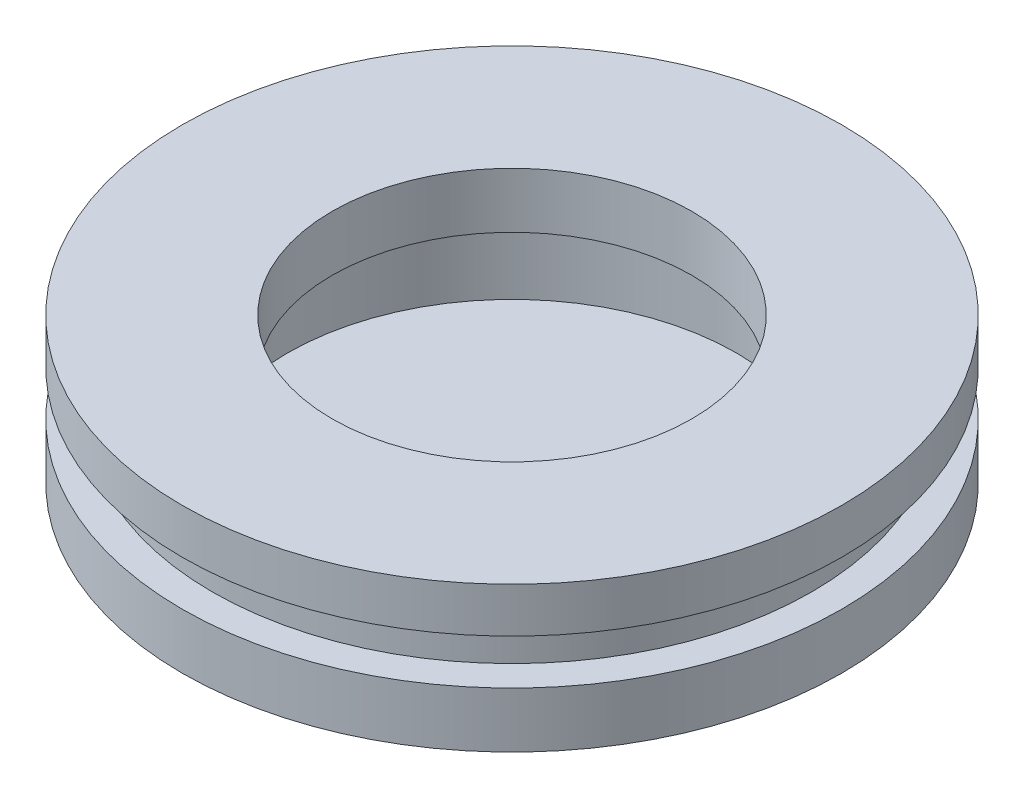
ISO-10303-21;
HEADER;
FILE_DESCRIPTION(('STEP AP214'),'2;1');
FILE_NAME('part.step','',(''),(''),'','','');
FILE_SCHEMA(('AUTOMOTIVE_DESIGN { 1 0 10303 214 1 1 1 1 }'));
ENDSEC;
DATA;
#1=APPLICATION_CONTEXT('core data for automotive mechanical design processes');
#2=APPLICATION_PROTOCOL_DEFINITION('international standard','automotive_design',2000,#1);
#3=PRODUCT_CONTEXT('',#1,'mechanical');
#4=PRODUCT('Part','Part','',(#3));
#5=PRODUCT_RELATED_PRODUCT_CATEGORY('part','',(#4));
#6=PRODUCT_DEFINITION_FORMATION('','',#4);
#7=PRODUCT_DEFINITION_CONTEXT('part definition',#1,'design');
#8=PRODUCT_DEFINITION('design','',#6,#7);
#9=PRODUCT_DEFINITION_SHAPE('','',#8);
#10=(LENGTH_UNIT() NAMED_UNIT(*) SI_UNIT(.MILLI.,.METRE.));
#11=(NAMED_UNIT(*) PLANE_ANGLE_UNIT() SI_UNIT($,.RADIAN.));
#12=(NAMED_UNIT(*) SI_UNIT($,.STERADIAN.) SOLID_ANGLE_UNIT());
#13=UNCERTAINTY_MEASURE_WITH_UNIT(LENGTH_MEASURE(1.E-05),#10,'distance_accuracy_value','');
#14=(GEOMETRIC_REPRESENTATION_CONTEXT(3) GLOBAL_UNCERTAINTY_ASSIGNED_CONTEXT((#13)) GLOBAL_UNIT_ASSIGNED_CONTEXT((#10,
#11,#12)) REPRESENTATION_CONTEXT('',''));
#15=CARTESIAN_POINT('',(0.,0.,0.));
#16=DIRECTION('',(0.,0.,1.));
#17=DIRECTION('',(1.,0.,0.));
#18=AXIS2_PLACEMENT_3D('',#15,#16,#17);
#19=CARTESIAN_POINT('',(0.,4.00367257692815,0.));
#20=DIRECTION('',(0.,1.,0.));
#21=DIRECTION('',(0.,0.,1.));
#22=AXIS2_PLACEMENT_3D('',#19,#20,#21);
#23=CONICAL_SURFACE('',#22,11.,1.22173047639604);
#24=CARTESIAN_POINT('',(0.,0.,0.));
#25=VERTEX_POINT('',#24);
#26=VERTEX_LOOP('',#25);
#27=FACE_BOUND('',#26,.T.);
#28=CARTESIAN_POINT('',(0.,4.00367257692815,0.));
#29=DIRECTION('',(0.,-1.,0.));
#30=DIRECTION('',(0.,0.,-1.));
#31=AXIS2_PLACEMENT_3D('',#28,#29,#30);
#32=CIRCLE('',#31,11.);
#33=CARTESIAN_POINT('',(0.,4.00367257692815,-11.));
#34=VERTEX_POINT('',#33);
#35=EDGE_CURVE('E49',#34,#34,#32,.T.);
#36=ORIENTED_EDGE('',*,*,#35,.T.);
#37=EDGE_LOOP('',(#36));
#38=FACE_BOUND('',#37,.T.);
#39=ADVANCED_FACE('F34',(#27,#38),#23,.T.);
#40=CARTESIAN_POINT('',(0.,8.85367257692815,0.));
#41=DIRECTION('',(0.,-1.,0.));
#42=DIRECTION('',(0.,0.,-1.));
#43=AXIS2_PLACEMENT_3D('',#40,#41,#42);
#44=PLANE('',#43);
#45=CARTESIAN_POINT('',(0.,8.85367257692815,0.));
#46=DIRECTION('',(0.,-1.,0.));
#47=DIRECTION('',(0.,0.,-1.));
#48=AXIS2_PLACEMENT_3D('',#45,#46,#47);
#49=CIRCLE('',#48,6.);
#50=CARTESIAN_POINT('',(0.,8.85367257692815,-6.));
#51=VERTEX_POINT('',#50);
#52=EDGE_CURVE('E37',#51,#51,#49,.F.);
#53=ORIENTED_EDGE('',*,*,#52,.F.);
#54=EDGE_LOOP('',(#53));
#55=FACE_BOUND('',#54,.T.);
#56=CARTESIAN_POINT('',(0.,8.85367257692815,0.));
#57=DIRECTION('',(0.,-1.,0.));
#58=DIRECTION('',(0.,0.,-1.));
#59=AXIS2_PLACEMENT_3D('',#56,#57,#58);
#60=CIRCLE('',#59,11.);
#61=CARTESIAN_POINT('',(0.,8.85367257692815,-11.));
#62=VERTEX_POINT('',#61);
#63=EDGE_CURVE('E11',#62,#62,#60,.T.);
#64=ORIENTED_EDGE('',*,*,#63,.F.);
#65=EDGE_LOOP('',(#64));
#66=FACE_BOUND('',#65,.T.);
#67=ADVANCED_FACE('F46',(#55,#66),#44,.F.);
#68=CARTESIAN_POINT('',(0.,0.,0.));
#69=DIRECTION('',(0.,-1.,0.));
#70=DIRECTION('',(0.,0.,-1.));
#71=AXIS2_PLACEMENT_3D('',#68,#69,#70);
#72=CYLINDRICAL_SURFACE('',#71,11.);
#73=CARTESIAN_POINT('',(0.,7.35367257692815,0.));
#74=DIRECTION('',(0.,-1.,0.));
#75=DIRECTION('',(0.,0.,-1.));
#76=AXIS2_PLACEMENT_3D('',#73,#74,#75);
#77=CIRCLE('',#76,11.);
#78=CARTESIAN_POINT('',(0.,7.35367257692815,-11.));
#79=VERTEX_POINT('',#78);
#80=EDGE_CURVE('E41',#79,#79,#77,.T.);
#81=ORIENTED_EDGE('',*,*,#80,.F.);
#82=EDGE_LOOP('',(#81));
#83=FACE_BOUND('',#82,.T.);
#84=ORIENTED_EDGE('',*,*,#63,.T.);
#85=EDGE_LOOP('',(#84));
#86=FACE_BOUND('',#85,.T.);
#87=ADVANCED_FACE('F71',(#83,#86),#72,.T.);
#88=CARTESIAN_POINT('',(-11.,7.35367257692815,0.));
#89=DIRECTION('',(0.,1.,0.));
#90=DIRECTION('',(0.,0.,1.));
#91=AXIS2_PLACEMENT_3D('',#88,#89,#90);
#92=PLANE('',#91);
#93=CARTESIAN_POINT('',(0.,7.35367257692815,0.));
#94=DIRECTION('',(0.,-1.,0.));
#95=DIRECTION('',(0.,0.,-1.));
#96=AXIS2_PLACEMENT_3D('',#93,#94,#95);
#97=CIRCLE('',#96,10.);
#98=CARTESIAN_POINT('',(0.,7.35367257692815,-10.));
#99=VERTEX_POINT('',#98);
#100=EDGE_CURVE('E63',#99,#99,#97,.T.);
#101=ORIENTED_EDGE('',*,*,#100,.F.);
#102=EDGE_LOOP('',(#101));
#103=FACE_BOUND('',#102,.T.);
#104=ORIENTED_EDGE('',*,*,#80,.T.);
#105=EDGE_LOOP('',(#104));
#106=FACE_BOUND('',#105,.T.);
#107=ADVANCED_FACE('F69',(#103,#106),#92,.F.);
#108=CARTESIAN_POINT('',(0.,0.,0.));
#109=DIRECTION('',(0.,-1.,0.));
#110=DIRECTION('',(0.,0.,-1.));
#111=AXIS2_PLACEMENT_3D('',#108,#109,#110);
#112=CYLINDRICAL_SURFACE('',#111,10.);
#113=CARTESIAN_POINT('',(0.,5.85367257692815,0.));
#114=DIRECTION('',(0.,-1.,0.));
#115=DIRECTION('',(0.,0.,-1.));
#116=AXIS2_PLACEMENT_3D('',#113,#114,#115);
#117=CIRCLE('',#116,10.);
#118=CARTESIAN_POINT('',(0.,5.85367257692815,-10.));
#119=VERTEX_POINT('',#118);
#120=EDGE_CURVE('E54',#119,#119,#117,.T.);
#121=ORIENTED_EDGE('',*,*,#120,.F.);
#122=EDGE_LOOP('',(#121));
#123=FACE_BOUND('',#122,.T.);
#124=ORIENTED_EDGE('',*,*,#100,.T.);
#125=EDGE_LOOP('',(#124));
#126=FACE_BOUND('',#125,.T.);
#127=ADVANCED_FACE('F85',(#123,#126),#112,.T.);
#128=CARTESIAN_POINT('',(-10.,5.85367257692815,0.));
#129=DIRECTION('',(0.,-1.,0.));
#130=DIRECTION('',(0.,0.,-1.));
#131=AXIS2_PLACEMENT_3D('',#128,#129,#130);
#132=PLANE('',#131);
#133=CARTESIAN_POINT('',(0.,5.85367257692815,0.));
#134=DIRECTION('',(0.,-1.,0.));
#135=DIRECTION('',(0.,0.,-1.));
#136=AXIS2_PLACEMENT_3D('',#133,#134,#135);
#137=CIRCLE('',#136,11.);
#138=CARTESIAN_POINT('',(0.,5.85367257692815,-11.));
#139=VERTEX_POINT('',#138);
#140=EDGE_CURVE('E51',#139,#139,#137,.T.);
#141=ORIENTED_EDGE('',*,*,#140,.F.);
#142=EDGE_LOOP('',(#141));
#143=FACE_BOUND('',#142,.T.);
#144=ORIENTED_EDGE('',*,*,#120,.T.);
#145=EDGE_LOOP('',(#144));
#146=FACE_BOUND('',#145,.T.);
#147=ADVANCED_FACE('F89',(#143,#146),#132,.F.);
#148=CARTESIAN_POINT('',(0.,0.,0.));
#149=DIRECTION('',(0.,-1.,0.));
#150=DIRECTION('',(0.,0.,-1.));
#151=AXIS2_PLACEMENT_3D('',#148,#149,#150);
#152=CYLINDRICAL_SURFACE('',#151,11.);
#153=ORIENTED_EDGE('',*,*,#35,.F.);
#154=EDGE_LOOP('',(#153));
#155=FACE_BOUND('',#154,.T.);
#156=ORIENTED_EDGE('',*,*,#140,.T.);
#157=EDGE_LOOP('',(#156));
#158=FACE_BOUND('',#157,.T.);
#159=ADVANCED_FACE('F93',(#155,#158),#152,.T.);
#160=CARTESIAN_POINT('',(0.,4.00367257692815,0.));
#161=DIRECTION('',(0.,-1.,0.));
#162=DIRECTION('',(0.,0.,-1.));
#163=AXIS2_PLACEMENT_3D('',#160,#161,#162);
#164=CYLINDRICAL_SURFACE('',#163,6.);
#165=CARTESIAN_POINT('',(0.,7.00367257692815,0.));
#166=DIRECTION('',(0.,-1.,0.));
#167=DIRECTION('',(0.,0.,-1.));
#168=AXIS2_PLACEMENT_3D('',#165,#166,#167);
#169=CIRCLE('',#168,6.);
#170=CARTESIAN_POINT('',(0.,7.00367257692815,-6.));
#171=VERTEX_POINT('',#170);
#172=EDGE_CURVE('E57',#171,#171,#169,.T.);
#173=ORIENTED_EDGE('',*,*,#172,.T.);
#174=EDGE_LOOP('',(#173));
#175=FACE_BOUND('',#174,.T.);
#176=ORIENTED_EDGE('',*,*,#52,.T.);
#177=EDGE_LOOP('',(#176));
#178=FACE_BOUND('',#177,.T.);
#179=ADVANCED_FACE('F97',(#175,#178),#164,.F.);
#180=CARTESIAN_POINT('',(-7.5,4.00367257692815,0.));
#181=DIRECTION('',(0.,1.,0.));
#182=DIRECTION('',(0.,0.,1.));
#183=AXIS2_PLACEMENT_3D('',#180,#181,#182);
#184=PLANE('',#183);
#185=CARTESIAN_POINT('',(0.,4.00367257692815,0.));
#186=DIRECTION('',(0.,-1.,0.));
#187=DIRECTION('',(0.,0.,-1.));
#188=AXIS2_PLACEMENT_3D('',#185,#186,#187);
#189=CIRCLE('',#188,7.5);
#190=CARTESIAN_POINT('',(0.,4.00367257692815,-7.5));
#191=VERTEX_POINT('',#190);
#192=EDGE_CURVE('E117',#191,#191,#189,.T.);
#193=ORIENTED_EDGE('',*,*,#192,.F.);
#194=EDGE_LOOP('',(#193));
#195=FACE_BOUND('',#194,.T.);
#196=ADVANCED_FACE('F98',(#195),#184,.T.);
#197=CARTESIAN_POINT('',(-6.,7.00367257692815,0.));
#198=DIRECTION('',(0.,-1.,0.));
#199=DIRECTION('',(0.,0.,-1.));
#200=AXIS2_PLACEMENT_3D('',#197,#198,#199);
#201=PLANE('',#200);
#202=CARTESIAN_POINT('',(0.,7.00367257692815,0.));
#203=DIRECTION('',(0.,-1.,0.));
#204=DIRECTION('',(0.,0.,-1.));
#205=AXIS2_PLACEMENT_3D('',#202,#203,#204);
#206=CIRCLE('',#205,7.5);
#207=CARTESIAN_POINT('',(0.,7.00367257692815,-7.5));
#208=VERTEX_POINT('',#207);
#209=EDGE_CURVE('E120',#208,#208,#206,.T.);
#210=ORIENTED_EDGE('',*,*,#209,.T.);
#211=EDGE_LOOP('',(#210));
#212=FACE_BOUND('',#211,.T.);
#213=ORIENTED_EDGE('',*,*,#172,.F.);
#214=EDGE_LOOP('',(#213));
#215=FACE_BOUND('',#214,.T.);
#216=ADVANCED_FACE('F101',(#212,#215),#201,.T.);
#217=CARTESIAN_POINT('',(0.,4.00367257692815,0.));
#218=DIRECTION('',(0.,-1.,0.));
#219=DIRECTION('',(0.,0.,-1.));
#220=AXIS2_PLACEMENT_3D('',#217,#218,#219);
#221=CYLINDRICAL_SURFACE('',#220,7.5);
#222=ORIENTED_EDGE('',*,*,#192,.T.);
#223=EDGE_LOOP('',(#222));
#224=FACE_BOUND('',#223,.T.);
#225=ORIENTED_EDGE('',*,*,#209,.F.);
#226=EDGE_LOOP('',(#225));
#227=FACE_BOUND('',#226,.T.);
#228=ADVANCED_FACE('F108',(#224,#227),#221,.F.);
#229=CLOSED_SHELL('',(#39,#67,#87,#107,#127,#147,#159,#179,#196,#216,#228));
#230=MANIFOLD_SOLID_BREP('B2',#229);
#231=ADVANCED_BREP_SHAPE_REPRESENTATION('',(#18,#230),#14);
#232=SHAPE_DEFINITION_REPRESENTATION(#9,#231);
ENDSEC;
END-ISO-10303-21;
